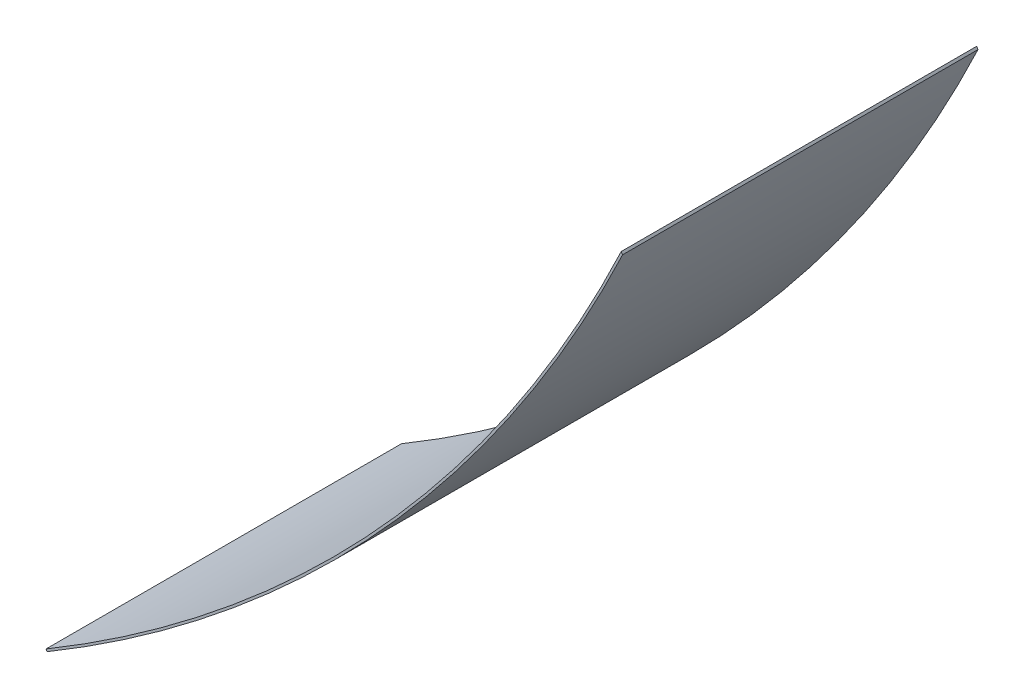
ISO-10303-21;
HEADER;
FILE_DESCRIPTION(('STEP AP214'),'2;1');
FILE_NAME('part.step','',(''),(''),'','','');
FILE_SCHEMA(('AUTOMOTIVE_DESIGN { 1 0 10303 214 1 1 1 1 }'));
ENDSEC;
DATA;
#1=APPLICATION_CONTEXT('core data for automotive mechanical design processes');
#2=APPLICATION_PROTOCOL_DEFINITION('international standard','automotive_design',2000,#1);
#3=PRODUCT_CONTEXT('',#1,'mechanical');
#4=PRODUCT('Part','Part','',(#3));
#5=PRODUCT_RELATED_PRODUCT_CATEGORY('part','',(#4));
#6=PRODUCT_DEFINITION_FORMATION('','',#4);
#7=PRODUCT_DEFINITION_CONTEXT('part definition',#1,'design');
#8=PRODUCT_DEFINITION('design','',#6,#7);
#9=PRODUCT_DEFINITION_SHAPE('','',#8);
#10=(LENGTH_UNIT() NAMED_UNIT(*) SI_UNIT(.MILLI.,.METRE.));
#11=(NAMED_UNIT(*) PLANE_ANGLE_UNIT() SI_UNIT($,.RADIAN.));
#12=(NAMED_UNIT(*) SI_UNIT($,.STERADIAN.) SOLID_ANGLE_UNIT());
#13=UNCERTAINTY_MEASURE_WITH_UNIT(LENGTH_MEASURE(1.E-05),#10,'distance_accuracy_value','');
#14=(GEOMETRIC_REPRESENTATION_CONTEXT(3) GLOBAL_UNCERTAINTY_ASSIGNED_CONTEXT((#13)) GLOBAL_UNIT_ASSIGNED_CONTEXT((#10,
#11,#12)) REPRESENTATION_CONTEXT('',''));
#15=CARTESIAN_POINT('',(0.,0.,0.));
#16=DIRECTION('',(0.,0.,1.));
#17=DIRECTION('',(1.,0.,0.));
#18=AXIS2_PLACEMENT_3D('',#15,#16,#17);
#19=CARTESIAN_POINT('',(-3412.34924773851,5885.24743515971,5639.9387865548));
#20=DIRECTION('',(0.,0.,-1.));
#21=DIRECTION('',(-1.,0.,0.));
#22=AXIS2_PLACEMENT_3D('',#19,#20,#21);
#23=CYLINDRICAL_SURFACE('',#22,6802.95996186147);
#24=CARTESIAN_POINT('',(-3412.34924773851,5885.24743515971,1653.72762964889));
#25=DIRECTION('',(0.,0.,1.));
#26=DIRECTION('',(0.,-1.,0.));
#27=AXIS2_PLACEMENT_3D('',#24,#25,#26);
#28=CIRCLE('',#27,6802.95996186147);
#29=CARTESIAN_POINT('',(2736.81313283652,2975.25323241445,1653.72762964889));
#30=VERTEX_POINT('',#29);
#31=CARTESIAN_POINT('',(60.3764013531221,35.4234370524775,1653.72762964889));
#32=VERTEX_POINT('',#31);
#33=EDGE_CURVE('E40',#30,#32,#28,.F.);
#34=ORIENTED_EDGE('',*,*,#33,.F.);
#35=DIRECTION('',(0.,0.,-1.));
#36=VECTOR('',#35,1.);
#37=CARTESIAN_POINT('',(2736.81313283652,2975.25323241445,5639.9387865548));
#38=LINE('',#37,#36);
#39=CARTESIAN_POINT('',(2736.81313283652,2975.25323241445,0.));
#40=VERTEX_POINT('',#39);
#41=EDGE_CURVE('E88',#30,#40,#38,.T.);
#42=ORIENTED_EDGE('',*,*,#41,.T.);
#43=CARTESIAN_POINT('',(-3412.34924773851,5885.24743515971,0.));
#44=DIRECTION('',(0.,0.,-1.));
#45=DIRECTION('',(1.,0.,0.));
#46=AXIS2_PLACEMENT_3D('',#43,#44,#45);
#47=CIRCLE('',#46,6802.95996186147);
#48=CARTESIAN_POINT('',(60.3764013531221,35.4234370524775,0.));
#49=VERTEX_POINT('',#48);
#50=EDGE_CURVE('E83',#40,#49,#47,.T.);
#51=ORIENTED_EDGE('',*,*,#50,.T.);
#52=DIRECTION('',(0.,0.,-1.));
#53=VECTOR('',#52,1.);
#54=CARTESIAN_POINT('',(60.3764013531221,35.4234370524775,5639.9387865548));
#55=LINE('',#54,#53);
#56=EDGE_CURVE('E69',#32,#49,#55,.T.);
#57=ORIENTED_EDGE('',*,*,#56,.F.);
#58=EDGE_LOOP('',(#34,#42,#51,#57));
#59=FACE_BOUND('',#58,.T.);
#60=ADVANCED_FACE('F33',(#59),#23,.F.);
#61=CARTESIAN_POINT('',(65.4811288078765,26.824497721802,5639.9387865548));
#62=DIRECTION('',(0.859893933067717,0.510472745475538,0.));
#63=DIRECTION('',(-0.510472745475538,0.859893933067717,0.));
#64=AXIS2_PLACEMENT_3D('',#61,#62,#63);
#65=PLANE('',#64);
#66=DIRECTION('',(0.510472745475538,-0.859893933067717,0.));
#67=VECTOR('',#66,1.);
#68=CARTESIAN_POINT('',(65.4811288078764,26.824497721802,1653.72762964889));
#69=LINE('',#68,#67);
#70=CARTESIAN_POINT('',(65.4811288078774,26.8244977218011,1653.72762964889));
#71=VERTEX_POINT('',#70);
#72=EDGE_CURVE('E49',#32,#71,#69,.T.);
#73=ORIENTED_EDGE('',*,*,#72,.F.);
#74=ORIENTED_EDGE('',*,*,#56,.T.);
#75=DIRECTION('',(0.510472745475538,-0.859893933067717,0.));
#76=VECTOR('',#75,1.);
#77=CARTESIAN_POINT('',(65.4811288078765,26.824497721802,0.));
#78=LINE('',#77,#76);
#79=CARTESIAN_POINT('',(65.4811288078765,26.824497721802,0.));
#80=VERTEX_POINT('',#79);
#81=EDGE_CURVE('E73',#49,#80,#78,.T.);
#82=ORIENTED_EDGE('',*,*,#81,.T.);
#83=DIRECTION('',(0.,0.,-1.));
#84=VECTOR('',#83,1.);
#85=CARTESIAN_POINT('',(65.4811288078765,26.824497721802,5639.9387865548));
#86=LINE('',#85,#84);
#87=EDGE_CURVE('E78',#71,#80,#86,.T.);
#88=ORIENTED_EDGE('',*,*,#87,.F.);
#89=EDGE_LOOP('',(#73,#74,#82,#88));
#90=FACE_BOUND('',#89,.T.);
#91=ADVANCED_FACE('F71',(#90),#65,.F.);
#92=CARTESIAN_POINT('',(-3412.34924773851,5885.24743515971,5639.9387865548));
#93=DIRECTION('',(0.,0.,-1.));
#94=DIRECTION('',(-1.,0.,0.));
#95=AXIS2_PLACEMENT_3D('',#92,#93,#94);
#96=CYLINDRICAL_SURFACE('',#95,6812.95996186147);
#97=CARTESIAN_POINT('',(-3412.34924773851,5885.24743515971,1653.72762964889));
#98=DIRECTION('',(0.,0.,1.));
#99=DIRECTION('',(0.,-1.,0.));
#100=AXIS2_PLACEMENT_3D('',#97,#98,#99);
#101=CIRCLE('',#100,6812.95996186147);
#102=CARTESIAN_POINT('',(2743.03317848281,2965.02644542397,1653.72762964889));
#103=VERTEX_POINT('',#102);
#104=EDGE_CURVE('E77',#71,#103,#101,.T.);
#105=ORIENTED_EDGE('',*,*,#104,.F.);
#106=ORIENTED_EDGE('',*,*,#87,.T.);
#107=CARTESIAN_POINT('',(-3412.34924773851,5885.24743515971,0.));
#108=DIRECTION('',(0.,0.,1.));
#109=DIRECTION('',(1.,0.,0.));
#110=AXIS2_PLACEMENT_3D('',#107,#108,#109);
#111=CIRCLE('',#110,6812.95996186147);
#112=CARTESIAN_POINT('',(2743.03317848281,2965.02644542397,0.));
#113=VERTEX_POINT('',#112);
#114=EDGE_CURVE('E85',#80,#113,#111,.T.);
#115=ORIENTED_EDGE('',*,*,#114,.T.);
#116=DIRECTION('',(0.,0.,-1.));
#117=VECTOR('',#116,1.);
#118=CARTESIAN_POINT('',(2743.03317848281,2965.02644542397,5639.9387865548));
#119=LINE('',#118,#117);
#120=EDGE_CURVE('E98',#103,#113,#119,.T.);
#121=ORIENTED_EDGE('',*,*,#120,.F.);
#122=EDGE_LOOP('',(#105,#106,#115,#121));
#123=FACE_BOUND('',#122,.T.);
#124=ADVANCED_FACE('F101',(#123),#96,.T.);
#125=CARTESIAN_POINT('',(2736.81313283652,2975.25323241445,5639.9387865548));
#126=DIRECTION('',(-0.854382361689395,-0.51964485952817,0.));
#127=DIRECTION('',(0.51964485952817,-0.854382361689395,0.));
#128=AXIS2_PLACEMENT_3D('',#125,#126,#127);
#129=PLANE('',#128);
#130=DIRECTION('',(-0.51964485952817,0.854382361689395,0.));
#131=VECTOR('',#130,1.);
#132=CARTESIAN_POINT('',(2736.81313283652,2975.25323241445,1653.72762964889));
#133=LINE('',#132,#131);
#134=EDGE_CURVE('E11',#103,#30,#133,.T.);
#135=ORIENTED_EDGE('',*,*,#134,.F.);
#136=ORIENTED_EDGE('',*,*,#120,.T.);
#137=DIRECTION('',(-0.51964485952817,0.854382361689395,0.));
#138=VECTOR('',#137,1.);
#139=CARTESIAN_POINT('',(2736.81313283652,2975.25323241445,0.));
#140=LINE('',#139,#138);
#141=EDGE_CURVE('E95',#113,#40,#140,.T.);
#142=ORIENTED_EDGE('',*,*,#141,.T.);
#143=ORIENTED_EDGE('',*,*,#41,.F.);
#144=EDGE_LOOP('',(#135,#136,#142,#143));
#145=FACE_BOUND('',#144,.T.);
#146=ADVANCED_FACE('F107',(#145),#129,.F.);
#147=CARTESIAN_POINT('',(-3412.34924773851,5885.24743515971,0.));
#148=DIRECTION('',(0.,0.,1.));
#149=DIRECTION('',(1.,0.,0.));
#150=AXIS2_PLACEMENT_3D('',#147,#148,#149);
#151=PLANE('',#150);
#152=ORIENTED_EDGE('',*,*,#50,.F.);
#153=ORIENTED_EDGE('',*,*,#141,.F.);
#154=ORIENTED_EDGE('',*,*,#114,.F.);
#155=ORIENTED_EDGE('',*,*,#81,.F.);
#156=EDGE_LOOP('',(#152,#153,#154,#155));
#157=FACE_BOUND('',#156,.T.);
#158=ADVANCED_FACE('F81',(#157),#151,.F.);
#159=CARTESIAN_POINT('',(-3412.34924773312,5885.24743518243,1653.72762964889));
#160=DIRECTION('',(0.,0.,1.));
#161=DIRECTION('',(1.,-5.49238432512311E-12,0.));
#162=AXIS2_PLACEMENT_3D('',#159,#160,#161);
#163=PLANE('',#162);
#164=ORIENTED_EDGE('',*,*,#33,.T.);
#165=ORIENTED_EDGE('',*,*,#72,.T.);
#166=ORIENTED_EDGE('',*,*,#104,.T.);
#167=ORIENTED_EDGE('',*,*,#134,.T.);
#168=EDGE_LOOP('',(#164,#165,#166,#167));
#169=FACE_BOUND('',#168,.T.);
#170=ADVANCED_FACE('F105',(#169),#163,.T.);
#171=CLOSED_SHELL('',(#60,#91,#124,#146,#158,#170));
#172=MANIFOLD_SOLID_BREP('B2',#171);
#173=ADVANCED_BREP_SHAPE_REPRESENTATION('',(#18,#172),#14);
#174=SHAPE_DEFINITION_REPRESENTATION(#9,#173);
ENDSEC;
END-ISO-10303-21;
